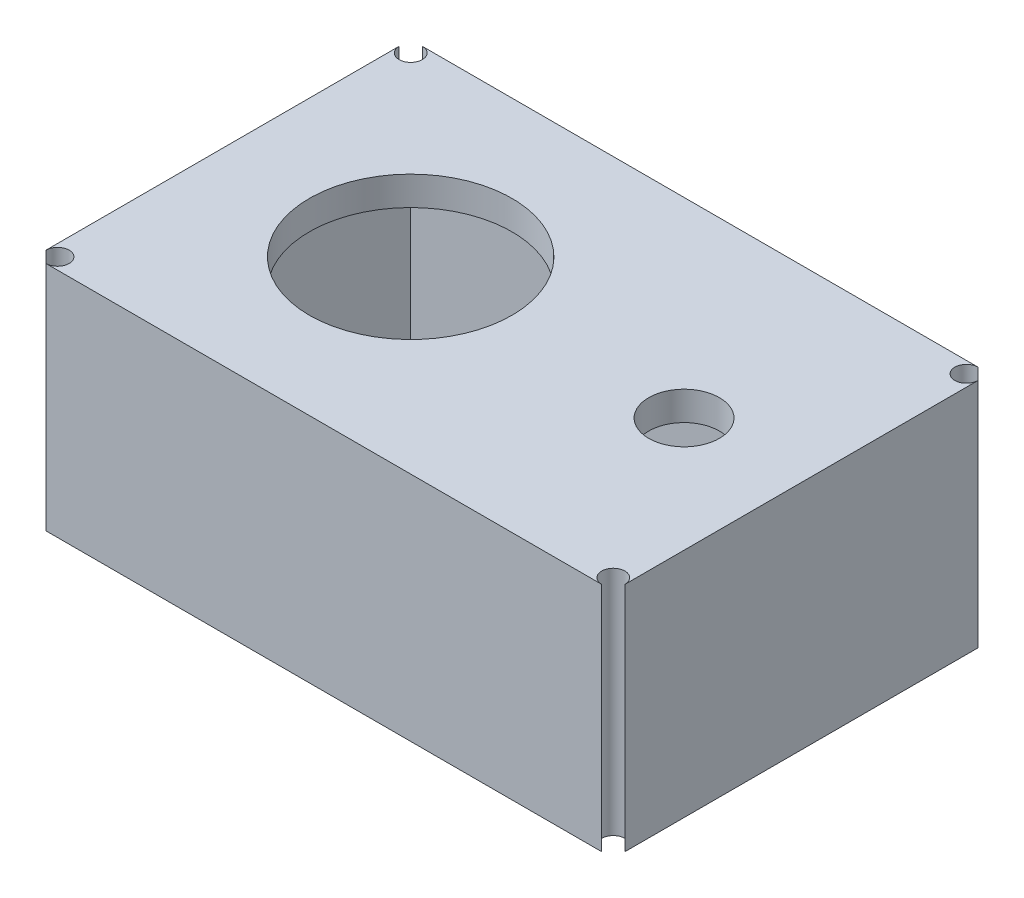
ISO-10303-21;
HEADER;
FILE_DESCRIPTION(('STEP AP214'),'2;1');
FILE_NAME('part.step','',(''),(''),'','','');
FILE_SCHEMA(('AUTOMOTIVE_DESIGN { 1 0 10303 214 1 1 1 1 }'));
ENDSEC;
DATA;
#1=APPLICATION_CONTEXT('core data for automotive mechanical design processes');
#2=APPLICATION_PROTOCOL_DEFINITION('international standard','automotive_design',2000,#1);
#3=PRODUCT_CONTEXT('',#1,'mechanical');
#4=PRODUCT('Part','Part','',(#3));
#5=PRODUCT_RELATED_PRODUCT_CATEGORY('part','',(#4));
#6=PRODUCT_DEFINITION_FORMATION('','',#4);
#7=PRODUCT_DEFINITION_CONTEXT('part definition',#1,'design');
#8=PRODUCT_DEFINITION('design','',#6,#7);
#9=PRODUCT_DEFINITION_SHAPE('','',#8);
#10=(LENGTH_UNIT() NAMED_UNIT(*) SI_UNIT(.MILLI.,.METRE.));
#11=(NAMED_UNIT(*) PLANE_ANGLE_UNIT() SI_UNIT($,.RADIAN.));
#12=(NAMED_UNIT(*) SI_UNIT($,.STERADIAN.) SOLID_ANGLE_UNIT());
#13=UNCERTAINTY_MEASURE_WITH_UNIT(LENGTH_MEASURE(1.E-05),#10,'distance_accuracy_value','');
#14=(GEOMETRIC_REPRESENTATION_CONTEXT(3) GLOBAL_UNCERTAINTY_ASSIGNED_CONTEXT((#13)) GLOBAL_UNIT_ASSIGNED_CONTEXT((#10,
#11,#12)) REPRESENTATION_CONTEXT('',''));
#15=CARTESIAN_POINT('',(0.,0.,0.));
#16=DIRECTION('',(0.,0.,1.));
#17=DIRECTION('',(1.,0.,0.));
#18=AXIS2_PLACEMENT_3D('',#15,#16,#17);
#19=CARTESIAN_POINT('',(0.,40.,0.));
#20=DIRECTION('',(0.,1.,0.));
#21=DIRECTION('',(0.,0.,1.));
#22=AXIS2_PLACEMENT_3D('',#19,#20,#21);
#23=PLANE('',#22);
#24=DIRECTION('',(1.,0.,0.));
#25=VECTOR('',#24,1.);
#26=CARTESIAN_POINT('',(-44.0677966101695,40.,31.9992295839753));
#27=LINE('',#26,#25);
#28=CARTESIAN_POINT('',(-42.0677966101695,40.,31.9992295839753));
#29=VERTEX_POINT('',#28);
#30=CARTESIAN_POINT('',(53.9322033898305,40.,31.9992295839753));
#31=VERTEX_POINT('',#30);
#32=EDGE_CURVE('E171',#29,#31,#27,.T.);
#33=ORIENTED_EDGE('',*,*,#32,.F.);
#34=CARTESIAN_POINT('',(-42.0677966101695,40.,29.9992295839753));
#35=DIRECTION('',(0.,1.,0.));
#36=DIRECTION('',(0.,0.,1.));
#37=AXIS2_PLACEMENT_3D('',#34,#35,#36);
#38=CIRCLE('',#37,2.);
#39=CARTESIAN_POINT('',(-44.0677966101695,40.,29.9992295839753));
#40=VERTEX_POINT('',#39);
#41=EDGE_CURVE('E167',#40,#29,#38,.F.);
#42=ORIENTED_EDGE('',*,*,#41,.F.);
#43=DIRECTION('',(0.,0.,1.));
#44=VECTOR('',#43,1.);
#45=CARTESIAN_POINT('',(-44.0677966101695,40.,-33.0007704160247));
#46=LINE('',#45,#44);
#47=CARTESIAN_POINT('',(-44.0677966101695,40.,-31.0007704160247));
#48=VERTEX_POINT('',#47);
#49=EDGE_CURVE('E163',#48,#40,#46,.T.);
#50=ORIENTED_EDGE('',*,*,#49,.F.);
#51=CARTESIAN_POINT('',(-42.0677966101695,40.,-31.0007704160247));
#52=DIRECTION('',(0.,1.,0.));
#53=DIRECTION('',(0.,0.,1.));
#54=AXIS2_PLACEMENT_3D('',#51,#52,#53);
#55=CIRCLE('',#54,2.);
#56=CARTESIAN_POINT('',(-42.0677966101695,40.,-33.0007704160247));
#57=VERTEX_POINT('',#56);
#58=EDGE_CURVE('E40',#57,#48,#55,.F.);
#59=ORIENTED_EDGE('',*,*,#58,.F.);
#60=DIRECTION('',(-1.,0.,0.));
#61=VECTOR('',#60,1.);
#62=CARTESIAN_POINT('',(-44.0677966101695,40.,-33.0007704160247));
#63=LINE('',#62,#61);
#64=CARTESIAN_POINT('',(53.9322033898305,40.,-33.0007704160247));
#65=VERTEX_POINT('',#64);
#66=EDGE_CURVE('E164',#65,#57,#63,.T.);
#67=ORIENTED_EDGE('',*,*,#66,.F.);
#68=CARTESIAN_POINT('',(53.9322033898305,40.,-31.0007704160247));
#69=DIRECTION('',(0.,1.,0.));
#70=DIRECTION('',(0.,0.,1.));
#71=AXIS2_PLACEMENT_3D('',#68,#69,#70);
#72=CIRCLE('',#71,2.);
#73=CARTESIAN_POINT('',(55.9322033898305,40.,-31.0007704160247));
#74=VERTEX_POINT('',#73);
#75=EDGE_CURVE('E175',#74,#65,#72,.F.);
#76=ORIENTED_EDGE('',*,*,#75,.F.);
#77=DIRECTION('',(0.,0.,1.));
#78=VECTOR('',#77,1.);
#79=CARTESIAN_POINT('',(55.9322033898305,40.,29.9992295839753));
#80=LINE('',#79,#78);
#81=CARTESIAN_POINT('',(55.9322033898305,40.,29.9992295839753));
#82=VERTEX_POINT('',#81);
#83=EDGE_CURVE('E11',#74,#82,#80,.T.);
#84=ORIENTED_EDGE('',*,*,#83,.T.);
#85=CARTESIAN_POINT('',(53.9322033898305,40.,29.9992295839753));
#86=DIRECTION('',(0.,1.,0.));
#87=DIRECTION('',(0.,0.,1.));
#88=AXIS2_PLACEMENT_3D('',#85,#86,#87);
#89=CIRCLE('',#88,2.);
#90=EDGE_CURVE('E48',#31,#82,#89,.F.);
#91=ORIENTED_EDGE('',*,*,#90,.F.);
#92=EDGE_LOOP('',(#33,#42,#50,#59,#67,#76,#84,#91));
#93=FACE_BOUND('',#92,.T.);
#94=DIRECTION('',(0.,0.,1.));
#95=VECTOR('',#94,1.);
#96=CARTESIAN_POINT('',(50.9322033898305,40.,-28.0007704160247));
#97=LINE('',#96,#95);
#98=CARTESIAN_POINT('',(50.9322033898305,40.,-28.0007704160247));
#99=VERTEX_POINT('',#98);
#100=CARTESIAN_POINT('',(50.9322033898305,40.,26.9992295839753));
#101=VERTEX_POINT('',#100);
#102=EDGE_CURVE('E180',#99,#101,#97,.T.);
#103=ORIENTED_EDGE('',*,*,#102,.F.);
#104=DIRECTION('',(1.,0.,0.));
#105=VECTOR('',#104,1.);
#106=CARTESIAN_POINT('',(-39.0677966101695,40.,-28.0007704160247));
#107=LINE('',#106,#105);
#108=CARTESIAN_POINT('',(-39.0677966101695,40.,-28.0007704160247));
#109=VERTEX_POINT('',#108);
#110=EDGE_CURVE('E179',#109,#99,#107,.T.);
#111=ORIENTED_EDGE('',*,*,#110,.F.);
#112=DIRECTION('',(0.,0.,-1.));
#113=VECTOR('',#112,1.);
#114=CARTESIAN_POINT('',(-39.0677966101695,40.,-28.0007704160247));
#115=LINE('',#114,#113);
#116=CARTESIAN_POINT('',(-39.0677966101695,40.,26.9992295839753));
#117=VERTEX_POINT('',#116);
#118=EDGE_CURVE('E174',#117,#109,#115,.T.);
#119=ORIENTED_EDGE('',*,*,#118,.F.);
#120=DIRECTION('',(-1.,0.,0.));
#121=VECTOR('',#120,1.);
#122=CARTESIAN_POINT('',(-39.0677966101695,40.,26.9992295839753));
#123=LINE('',#122,#121);
#124=EDGE_CURVE('E35',#101,#117,#123,.T.);
#125=ORIENTED_EDGE('',*,*,#124,.F.);
#126=EDGE_LOOP('',(#103,#111,#119,#125));
#127=FACE_BOUND('',#126,.T.);
#128=ADVANCED_FACE('F32',(#93,#127),#23,.F.);
#129=CARTESIAN_POINT('',(55.9322033898305,80.,-33.0007704160247));
#130=DIRECTION('',(-1.,0.,0.));
#131=DIRECTION('',(0.,0.,1.));
#132=AXIS2_PLACEMENT_3D('',#129,#130,#131);
#133=PLANE('',#132);
#134=ORIENTED_EDGE('',*,*,#83,.F.);
#135=DIRECTION('',(0.,1.,0.));
#136=VECTOR('',#135,1.);
#137=CARTESIAN_POINT('',(55.9322033898305,-0.00999999999999612,-31.0007704160247));
#138=LINE('',#137,#136);
#139=CARTESIAN_POINT('',(55.9322033898305,80.,-31.0007704160247));
#140=VERTEX_POINT('',#139);
#141=EDGE_CURVE('E161',#74,#140,#138,.T.);
#142=ORIENTED_EDGE('',*,*,#141,.T.);
#143=DIRECTION('',(0.,0.,-1.));
#144=VECTOR('',#143,1.);
#145=CARTESIAN_POINT('',(55.9322033898305,80.,-33.0007704160247));
#146=LINE('',#145,#144);
#147=CARTESIAN_POINT('',(55.9322033898305,80.,29.9992295839753));
#148=VERTEX_POINT('',#147);
#149=EDGE_CURVE('E154',#148,#140,#146,.T.);
#150=ORIENTED_EDGE('',*,*,#149,.F.);
#151=DIRECTION('',(0.,1.,0.));
#152=VECTOR('',#151,1.);
#153=CARTESIAN_POINT('',(55.9322033898305,-0.00999999999999612,29.9992295839753));
#154=LINE('',#153,#152);
#155=EDGE_CURVE('E227',#82,#148,#154,.T.);
#156=ORIENTED_EDGE('',*,*,#155,.F.);
#157=EDGE_LOOP('',(#134,#142,#150,#156));
#158=FACE_BOUND('',#157,.T.);
#159=ADVANCED_FACE('F251',(#158),#133,.F.);
#160=CARTESIAN_POINT('',(50.9322033898305,-175.475115548645,-28.0007704160247));
#161=DIRECTION('',(1.,0.,0.));
#162=DIRECTION('',(0.,0.,-1.));
#163=AXIS2_PLACEMENT_3D('',#160,#161,#162);
#164=PLANE('',#163);
#165=DIRECTION('',(0.,1.,0.));
#166=VECTOR('',#165,1.);
#167=CARTESIAN_POINT('',(50.9322033898305,-175.475115548645,-28.0007704160247));
#168=LINE('',#167,#166);
#169=CARTESIAN_POINT('',(50.9322033898305,75.,-28.0007704160247));
#170=VERTEX_POINT('',#169);
#171=EDGE_CURVE('E151',#99,#170,#168,.T.);
#172=ORIENTED_EDGE('',*,*,#171,.F.);
#173=ORIENTED_EDGE('',*,*,#102,.T.);
#174=DIRECTION('',(0.,1.,0.));
#175=VECTOR('',#174,1.);
#176=CARTESIAN_POINT('',(50.9322033898305,-175.475115548645,26.9992295839753));
#177=LINE('',#176,#175);
#178=CARTESIAN_POINT('',(50.9322033898305,75.,26.9992295839753));
#179=VERTEX_POINT('',#178);
#180=EDGE_CURVE('E193',#101,#179,#177,.T.);
#181=ORIENTED_EDGE('',*,*,#180,.T.);
#182=DIRECTION('',(0.,0.,-1.));
#183=VECTOR('',#182,1.);
#184=CARTESIAN_POINT('',(50.9322033898305,75.,-28.0007704160247));
#185=LINE('',#184,#183);
#186=EDGE_CURVE('E205',#179,#170,#185,.T.);
#187=ORIENTED_EDGE('',*,*,#186,.T.);
#188=EDGE_LOOP('',(#172,#173,#181,#187));
#189=FACE_BOUND('',#188,.T.);
#190=ADVANCED_FACE('F265',(#189),#164,.F.);
#191=CARTESIAN_POINT('',(0.,75.,0.));
#192=DIRECTION('',(0.,1.,0.));
#193=DIRECTION('',(0.,0.,1.));
#194=AXIS2_PLACEMENT_3D('',#191,#192,#193);
#195=PLANE('',#194);
#196=CARTESIAN_POINT('',(36.1553778472485,75.,0.));
#197=DIRECTION('',(0.,1.,0.));
#198=DIRECTION('',(0.,0.,1.));
#199=AXIS2_PLACEMENT_3D('',#196,#197,#198);
#200=CIRCLE('',#199,6.10322585973708);
#201=CARTESIAN_POINT('',(36.1553778472485,75.,6.10322585973708));
#202=VERTEX_POINT('',#201);
#203=EDGE_CURVE('E219',#202,#202,#200,.T.);
#204=ORIENTED_EDGE('',*,*,#203,.T.);
#205=EDGE_LOOP('',(#204));
#206=FACE_BOUND('',#205,.T.);
#207=CARTESIAN_POINT('',(-11.5677966101695,75.,-0.50077041602465));
#208=DIRECTION('',(0.,1.,0.));
#209=DIRECTION('',(0.,0.,1.));
#210=AXIS2_PLACEMENT_3D('',#207,#208,#209);
#211=CIRCLE('',#210,17.5);
#212=CARTESIAN_POINT('',(-11.5677966101695,75.,16.9992295839754));
#213=VERTEX_POINT('',#212);
#214=EDGE_CURVE('E215',#213,#213,#211,.T.);
#215=ORIENTED_EDGE('',*,*,#214,.T.);
#216=EDGE_LOOP('',(#215));
#217=FACE_BOUND('',#216,.T.);
#218=DIRECTION('',(0.,0.,1.));
#219=VECTOR('',#218,1.);
#220=CARTESIAN_POINT('',(-39.0677966101695,75.,-28.0007704160247));
#221=LINE('',#220,#219);
#222=CARTESIAN_POINT('',(-39.0677966101695,75.,-28.0007704160247));
#223=VERTEX_POINT('',#222);
#224=CARTESIAN_POINT('',(-39.0677966101695,75.,26.9992295839753));
#225=VERTEX_POINT('',#224);
#226=EDGE_CURVE('E200',#223,#225,#221,.T.);
#227=ORIENTED_EDGE('',*,*,#226,.F.);
#228=DIRECTION('',(-1.,0.,0.));
#229=VECTOR('',#228,1.);
#230=CARTESIAN_POINT('',(-39.0677966101695,75.,-28.0007704160247));
#231=LINE('',#230,#229);
#232=EDGE_CURVE('E202',#170,#223,#231,.T.);
#233=ORIENTED_EDGE('',*,*,#232,.F.);
#234=ORIENTED_EDGE('',*,*,#186,.F.);
#235=DIRECTION('',(1.,0.,0.));
#236=VECTOR('',#235,1.);
#237=CARTESIAN_POINT('',(-39.0677966101695,75.,26.9992295839753));
#238=LINE('',#237,#236);
#239=EDGE_CURVE('E212',#225,#179,#238,.T.);
#240=ORIENTED_EDGE('',*,*,#239,.F.);
#241=EDGE_LOOP('',(#227,#233,#234,#240));
#242=FACE_BOUND('',#241,.T.);
#243=ADVANCED_FACE('F271',(#206,#217,#242),#195,.F.);
#244=CARTESIAN_POINT('',(-39.0677966101695,-175.475115548645,-28.0007704160247));
#245=DIRECTION('',(0.,0.,-1.));
#246=DIRECTION('',(-1.,0.,0.));
#247=AXIS2_PLACEMENT_3D('',#244,#245,#246);
#248=PLANE('',#247);
#249=DIRECTION('',(0.,1.,0.));
#250=VECTOR('',#249,1.);
#251=CARTESIAN_POINT('',(-39.0677966101695,-175.475115548645,-28.0007704160247));
#252=LINE('',#251,#250);
#253=EDGE_CURVE('E148',#109,#223,#252,.T.);
#254=ORIENTED_EDGE('',*,*,#253,.F.);
#255=ORIENTED_EDGE('',*,*,#110,.T.);
#256=ORIENTED_EDGE('',*,*,#171,.T.);
#257=ORIENTED_EDGE('',*,*,#232,.T.);
#258=EDGE_LOOP('',(#254,#255,#256,#257));
#259=FACE_BOUND('',#258,.T.);
#260=ADVANCED_FACE('F334',(#259),#248,.F.);
#261=CARTESIAN_POINT('',(-39.0677966101695,-175.475115548645,26.9992295839753));
#262=DIRECTION('',(0.,0.,1.));
#263=DIRECTION('',(1.,0.,0.));
#264=AXIS2_PLACEMENT_3D('',#261,#262,#263);
#265=PLANE('',#264);
#266=ORIENTED_EDGE('',*,*,#180,.F.);
#267=ORIENTED_EDGE('',*,*,#124,.T.);
#268=DIRECTION('',(0.,1.,0.));
#269=VECTOR('',#268,1.);
#270=CARTESIAN_POINT('',(-39.0677966101695,-175.475115548645,26.9992295839753));
#271=LINE('',#270,#269);
#272=EDGE_CURVE('E191',#117,#225,#271,.T.);
#273=ORIENTED_EDGE('',*,*,#272,.T.);
#274=ORIENTED_EDGE('',*,*,#239,.T.);
#275=EDGE_LOOP('',(#266,#267,#273,#274));
#276=FACE_BOUND('',#275,.T.);
#277=ADVANCED_FACE('F188',(#276),#265,.F.);
#278=CARTESIAN_POINT('',(-39.0677966101695,-175.475115548645,-28.0007704160247));
#279=DIRECTION('',(-1.,0.,0.));
#280=DIRECTION('',(0.,0.,1.));
#281=AXIS2_PLACEMENT_3D('',#278,#279,#280);
#282=PLANE('',#281);
#283=ORIENTED_EDGE('',*,*,#272,.F.);
#284=ORIENTED_EDGE('',*,*,#118,.T.);
#285=ORIENTED_EDGE('',*,*,#253,.T.);
#286=ORIENTED_EDGE('',*,*,#226,.T.);
#287=EDGE_LOOP('',(#283,#284,#285,#286));
#288=FACE_BOUND('',#287,.T.);
#289=ADVANCED_FACE('F198',(#288),#282,.F.);
#290=CARTESIAN_POINT('',(-11.5677966101695,75.,-0.50077041602465));
#291=DIRECTION('',(0.,1.,0.));
#292=DIRECTION('',(0.,0.,1.));
#293=AXIS2_PLACEMENT_3D('',#290,#291,#292);
#294=CYLINDRICAL_SURFACE('',#293,17.5);
#295=ORIENTED_EDGE('',*,*,#214,.F.);
#296=EDGE_LOOP('',(#295));
#297=FACE_BOUND('',#296,.T.);
#298=CARTESIAN_POINT('',(-11.5677966101695,80.,-0.50077041602465));
#299=DIRECTION('',(0.,1.,0.));
#300=DIRECTION('',(0.,0.,1.));
#301=AXIS2_PLACEMENT_3D('',#298,#299,#300);
#302=CIRCLE('',#301,17.5);
#303=CARTESIAN_POINT('',(-11.5677966101695,80.,16.9992295839754));
#304=VERTEX_POINT('',#303);
#305=EDGE_CURVE('E216',#304,#304,#302,.T.);
#306=ORIENTED_EDGE('',*,*,#305,.T.);
#307=EDGE_LOOP('',(#306));
#308=FACE_BOUND('',#307,.T.);
#309=ADVANCED_FACE('F359',(#297,#308),#294,.F.);
#310=CARTESIAN_POINT('',(36.1553778472485,75.,0.));
#311=DIRECTION('',(0.,1.,0.));
#312=DIRECTION('',(0.,0.,1.));
#313=AXIS2_PLACEMENT_3D('',#310,#311,#312);
#314=CYLINDRICAL_SURFACE('',#313,6.10322585973708);
#315=ORIENTED_EDGE('',*,*,#203,.F.);
#316=EDGE_LOOP('',(#315));
#317=FACE_BOUND('',#316,.T.);
#318=CARTESIAN_POINT('',(36.1553778472485,80.,0.));
#319=DIRECTION('',(0.,1.,0.));
#320=DIRECTION('',(0.,0.,1.));
#321=AXIS2_PLACEMENT_3D('',#318,#319,#320);
#322=CIRCLE('',#321,6.10322585973708);
#323=CARTESIAN_POINT('',(36.1553778472485,80.,6.10322585973708));
#324=VERTEX_POINT('',#323);
#325=EDGE_CURVE('E165',#324,#324,#322,.T.);
#326=ORIENTED_EDGE('',*,*,#325,.T.);
#327=EDGE_LOOP('',(#326));
#328=FACE_BOUND('',#327,.T.);
#329=ADVANCED_FACE('F284',(#317,#328),#314,.F.);
#330=CARTESIAN_POINT('',(-44.0677966101695,80.,-33.0007704160247));
#331=DIRECTION('',(0.,0.,1.));
#332=DIRECTION('',(1.,0.,0.));
#333=AXIS2_PLACEMENT_3D('',#330,#331,#332);
#334=PLANE('',#333);
#335=DIRECTION('',(0.,1.,0.));
#336=VECTOR('',#335,1.);
#337=CARTESIAN_POINT('',(53.9322033898305,-0.00999999999999612,-33.0007704160247));
#338=LINE('',#337,#336);
#339=CARTESIAN_POINT('',(53.9322033898305,80.,-33.0007704160247));
#340=VERTEX_POINT('',#339);
#341=EDGE_CURVE('E142',#65,#340,#338,.T.);
#342=ORIENTED_EDGE('',*,*,#341,.F.);
#343=ORIENTED_EDGE('',*,*,#66,.T.);
#344=DIRECTION('',(0.,1.,0.));
#345=VECTOR('',#344,1.);
#346=CARTESIAN_POINT('',(-42.0677966101695,-0.00999999999999612,-33.0007704160247));
#347=LINE('',#346,#345);
#348=CARTESIAN_POINT('',(-42.0677966101695,80.,-33.0007704160247));
#349=VERTEX_POINT('',#348);
#350=EDGE_CURVE('E160',#57,#349,#347,.T.);
#351=ORIENTED_EDGE('',*,*,#350,.T.);
#352=DIRECTION('',(-1.,0.,0.));
#353=VECTOR('',#352,1.);
#354=CARTESIAN_POINT('',(-44.0677966101695,80.,-33.0007704160247));
#355=LINE('',#354,#353);
#356=EDGE_CURVE('E141',#340,#349,#355,.T.);
#357=ORIENTED_EDGE('',*,*,#356,.F.);
#358=EDGE_LOOP('',(#342,#343,#351,#357));
#359=FACE_BOUND('',#358,.T.);
#360=ADVANCED_FACE('F257',(#359),#334,.F.);
#361=CARTESIAN_POINT('',(53.9322033898305,-0.00999999999999612,-31.0007704160247));
#362=DIRECTION('',(0.,1.,0.));
#363=DIRECTION('',(0.,0.,1.));
#364=AXIS2_PLACEMENT_3D('',#361,#362,#363);
#365=CYLINDRICAL_SURFACE('',#364,2.);
#366=ORIENTED_EDGE('',*,*,#141,.F.);
#367=ORIENTED_EDGE('',*,*,#75,.T.);
#368=ORIENTED_EDGE('',*,*,#341,.T.);
#369=CARTESIAN_POINT('',(53.9322033898305,80.,-31.0007704160247));
#370=DIRECTION('',(0.,1.,0.));
#371=DIRECTION('',(0.,0.,1.));
#372=AXIS2_PLACEMENT_3D('',#369,#370,#371);
#373=CIRCLE('',#372,2.);
#374=EDGE_CURVE('E230',#340,#140,#373,.T.);
#375=ORIENTED_EDGE('',*,*,#374,.T.);
#376=EDGE_LOOP('',(#366,#367,#368,#375));
#377=FACE_BOUND('',#376,.T.);
#378=ADVANCED_FACE('F254',(#377),#365,.F.);
#379=CARTESIAN_POINT('',(53.9322033898305,-0.00999999999999612,29.9992295839753));
#380=DIRECTION('',(0.,1.,0.));
#381=DIRECTION('',(0.,0.,1.));
#382=AXIS2_PLACEMENT_3D('',#379,#380,#381);
#383=CYLINDRICAL_SURFACE('',#382,2.);
#384=DIRECTION('',(0.,1.,0.));
#385=VECTOR('',#384,1.);
#386=CARTESIAN_POINT('',(53.9322033898305,-0.00999999999999612,31.9992295839753));
#387=LINE('',#386,#385);
#388=CARTESIAN_POINT('',(53.9322033898305,80.,31.9992295839753));
#389=VERTEX_POINT('',#388);
#390=EDGE_CURVE('E229',#31,#389,#387,.T.);
#391=ORIENTED_EDGE('',*,*,#390,.F.);
#392=ORIENTED_EDGE('',*,*,#90,.T.);
#393=ORIENTED_EDGE('',*,*,#155,.T.);
#394=CARTESIAN_POINT('',(53.9322033898305,80.,29.9992295839753));
#395=DIRECTION('',(0.,1.,0.));
#396=DIRECTION('',(0.,0.,1.));
#397=AXIS2_PLACEMENT_3D('',#394,#395,#396);
#398=CIRCLE('',#397,2.);
#399=EDGE_CURVE('E233',#148,#389,#398,.T.);
#400=ORIENTED_EDGE('',*,*,#399,.T.);
#401=EDGE_LOOP('',(#391,#392,#393,#400));
#402=FACE_BOUND('',#401,.T.);
#403=ADVANCED_FACE('F249',(#402),#383,.F.);
#404=CARTESIAN_POINT('',(-44.0677966101695,80.,31.9992295839753));
#405=DIRECTION('',(0.,0.,-1.));
#406=DIRECTION('',(-1.,0.,0.));
#407=AXIS2_PLACEMENT_3D('',#404,#405,#406);
#408=PLANE('',#407);
#409=DIRECTION('',(0.,1.,0.));
#410=VECTOR('',#409,1.);
#411=CARTESIAN_POINT('',(-42.0677966101695,-0.00999999999999612,31.9992295839753));
#412=LINE('',#411,#410);
#413=CARTESIAN_POINT('',(-42.0677966101695,80.,31.9992295839753));
#414=VERTEX_POINT('',#413);
#415=EDGE_CURVE('E131',#29,#414,#412,.T.);
#416=ORIENTED_EDGE('',*,*,#415,.F.);
#417=ORIENTED_EDGE('',*,*,#32,.T.);
#418=ORIENTED_EDGE('',*,*,#390,.T.);
#419=DIRECTION('',(1.,0.,0.));
#420=VECTOR('',#419,1.);
#421=CARTESIAN_POINT('',(-44.0677966101695,80.,31.9992295839753));
#422=LINE('',#421,#420);
#423=EDGE_CURVE('E149',#414,#389,#422,.T.);
#424=ORIENTED_EDGE('',*,*,#423,.F.);
#425=EDGE_LOOP('',(#416,#417,#418,#424));
#426=FACE_BOUND('',#425,.T.);
#427=ADVANCED_FACE('F248',(#426),#408,.F.);
#428=CARTESIAN_POINT('',(-42.0677966101695,-0.00999999999999612,29.9992295839753));
#429=DIRECTION('',(0.,1.,0.));
#430=DIRECTION('',(0.,0.,1.));
#431=AXIS2_PLACEMENT_3D('',#428,#429,#430);
#432=CYLINDRICAL_SURFACE('',#431,2.);
#433=DIRECTION('',(0.,1.,0.));
#434=VECTOR('',#433,1.);
#435=CARTESIAN_POINT('',(-44.0677966101695,-0.00999999999999612,29.9992295839753));
#436=LINE('',#435,#434);
#437=CARTESIAN_POINT('',(-44.0677966101695,80.,29.9992295839753));
#438=VERTEX_POINT('',#437);
#439=EDGE_CURVE('E130',#40,#438,#436,.T.);
#440=ORIENTED_EDGE('',*,*,#439,.F.);
#441=ORIENTED_EDGE('',*,*,#41,.T.);
#442=ORIENTED_EDGE('',*,*,#415,.T.);
#443=CARTESIAN_POINT('',(-42.0677966101695,80.,29.9992295839753));
#444=DIRECTION('',(0.,1.,0.));
#445=DIRECTION('',(0.,0.,1.));
#446=AXIS2_PLACEMENT_3D('',#443,#444,#445);
#447=CIRCLE('',#446,2.);
#448=EDGE_CURVE('E143',#414,#438,#447,.T.);
#449=ORIENTED_EDGE('',*,*,#448,.T.);
#450=EDGE_LOOP('',(#440,#441,#442,#449));
#451=FACE_BOUND('',#450,.T.);
#452=ADVANCED_FACE('F242',(#451),#432,.F.);
#453=CARTESIAN_POINT('',(-44.0677966101695,80.,-33.0007704160247));
#454=DIRECTION('',(1.,0.,0.));
#455=DIRECTION('',(0.,0.,-1.));
#456=AXIS2_PLACEMENT_3D('',#453,#454,#455);
#457=PLANE('',#456);
#458=DIRECTION('',(0.,1.,0.));
#459=VECTOR('',#458,1.);
#460=CARTESIAN_POINT('',(-44.0677966101695,-0.00999999999999612,-31.0007704160247));
#461=LINE('',#460,#459);
#462=CARTESIAN_POINT('',(-44.0677966101695,80.,-31.0007704160247));
#463=VERTEX_POINT('',#462);
#464=EDGE_CURVE('E120',#48,#463,#461,.T.);
#465=ORIENTED_EDGE('',*,*,#464,.F.);
#466=ORIENTED_EDGE('',*,*,#49,.T.);
#467=ORIENTED_EDGE('',*,*,#439,.T.);
#468=DIRECTION('',(0.,0.,1.));
#469=VECTOR('',#468,1.);
#470=CARTESIAN_POINT('',(-44.0677966101695,80.,-33.0007704160247));
#471=LINE('',#470,#469);
#472=EDGE_CURVE('E138',#463,#438,#471,.T.);
#473=ORIENTED_EDGE('',*,*,#472,.F.);
#474=EDGE_LOOP('',(#465,#466,#467,#473));
#475=FACE_BOUND('',#474,.T.);
#476=ADVANCED_FACE('F145',(#475),#457,.F.);
#477=CARTESIAN_POINT('',(-42.0677966101695,-0.00999999999999612,-31.0007704160247));
#478=DIRECTION('',(0.,1.,0.));
#479=DIRECTION('',(0.,0.,1.));
#480=AXIS2_PLACEMENT_3D('',#477,#478,#479);
#481=CYLINDRICAL_SURFACE('',#480,2.);
#482=ORIENTED_EDGE('',*,*,#350,.F.);
#483=ORIENTED_EDGE('',*,*,#58,.T.);
#484=ORIENTED_EDGE('',*,*,#464,.T.);
#485=CARTESIAN_POINT('',(-42.0677966101695,80.,-31.0007704160247));
#486=DIRECTION('',(0.,1.,0.));
#487=DIRECTION('',(0.,0.,1.));
#488=AXIS2_PLACEMENT_3D('',#485,#486,#487);
#489=CIRCLE('',#488,2.);
#490=EDGE_CURVE('E124',#463,#349,#489,.T.);
#491=ORIENTED_EDGE('',*,*,#490,.T.);
#492=EDGE_LOOP('',(#482,#483,#484,#491));
#493=FACE_BOUND('',#492,.T.);
#494=ADVANCED_FACE('F123',(#493),#481,.F.);
#495=CARTESIAN_POINT('',(0.,80.,0.));
#496=DIRECTION('',(0.,1.,0.));
#497=DIRECTION('',(0.,0.,1.));
#498=AXIS2_PLACEMENT_3D('',#495,#496,#497);
#499=PLANE('',#498);
#500=ORIENTED_EDGE('',*,*,#490,.F.);
#501=ORIENTED_EDGE('',*,*,#472,.T.);
#502=ORIENTED_EDGE('',*,*,#448,.F.);
#503=ORIENTED_EDGE('',*,*,#423,.T.);
#504=ORIENTED_EDGE('',*,*,#399,.F.);
#505=ORIENTED_EDGE('',*,*,#149,.T.);
#506=ORIENTED_EDGE('',*,*,#374,.F.);
#507=ORIENTED_EDGE('',*,*,#356,.T.);
#508=EDGE_LOOP('',(#500,#501,#502,#503,#504,#505,#506,#507));
#509=FACE_BOUND('',#508,.T.);
#510=ORIENTED_EDGE('',*,*,#325,.F.);
#511=EDGE_LOOP('',(#510));
#512=FACE_BOUND('',#511,.T.);
#513=ORIENTED_EDGE('',*,*,#305,.F.);
#514=EDGE_LOOP('',(#513));
#515=FACE_BOUND('',#514,.T.);
#516=ADVANCED_FACE('F135',(#509,#512,#515),#499,.T.);
#517=CLOSED_SHELL('',(#128,#159,#190,#243,#260,#277,#289,#309,#329,#360,#378,#403,#427,#452,
#476,#494,#516));
#518=MANIFOLD_SOLID_BREP('B2',#517);
#519=ADVANCED_BREP_SHAPE_REPRESENTATION('',(#18,#518),#14);
#520=SHAPE_DEFINITION_REPRESENTATION(#9,#519);
ENDSEC;
END-ISO-10303-21;
